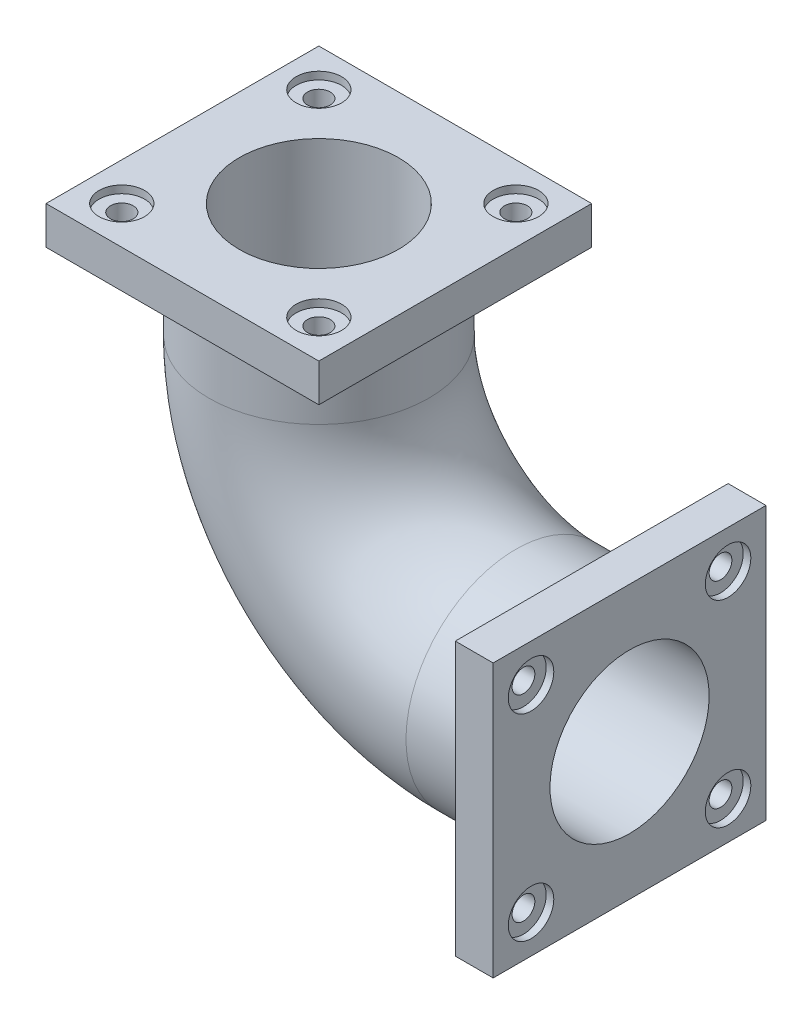
ISO-10303-21;
HEADER;
FILE_DESCRIPTION(('STEP AP214'),'2;1');
FILE_NAME('part.step','',(''),(''),'','','');
FILE_SCHEMA(('AUTOMOTIVE_DESIGN { 1 0 10303 214 1 1 1 1 }'));
ENDSEC;
DATA;
#1=APPLICATION_CONTEXT('core data for automotive mechanical design processes');
#2=APPLICATION_PROTOCOL_DEFINITION('international standard','automotive_design',2000,#1);
#3=PRODUCT_CONTEXT('',#1,'mechanical');
#4=PRODUCT('Part','Part','',(#3));
#5=PRODUCT_RELATED_PRODUCT_CATEGORY('part','',(#4));
#6=PRODUCT_DEFINITION_FORMATION('','',#4);
#7=PRODUCT_DEFINITION_CONTEXT('part definition',#1,'design');
#8=PRODUCT_DEFINITION('design','',#6,#7);
#9=PRODUCT_DEFINITION_SHAPE('','',#8);
#10=(LENGTH_UNIT() NAMED_UNIT(*) SI_UNIT(.MILLI.,.METRE.));
#11=(NAMED_UNIT(*) PLANE_ANGLE_UNIT() SI_UNIT($,.RADIAN.));
#12=(NAMED_UNIT(*) SI_UNIT($,.STERADIAN.) SOLID_ANGLE_UNIT());
#13=UNCERTAINTY_MEASURE_WITH_UNIT(LENGTH_MEASURE(1.E-05),#10,'distance_accuracy_value','');
#14=(GEOMETRIC_REPRESENTATION_CONTEXT(3) GLOBAL_UNCERTAINTY_ASSIGNED_CONTEXT((#13)) GLOBAL_UNIT_ASSIGNED_CONTEXT((#10,
#11,#12)) REPRESENTATION_CONTEXT('',''));
#15=CARTESIAN_POINT('',(0.,0.,0.));
#16=DIRECTION('',(0.,0.,1.));
#17=DIRECTION('',(1.,0.,0.));
#18=AXIS2_PLACEMENT_3D('',#15,#16,#17);
#19=CARTESIAN_POINT('',(-50.,0.,0.));
#20=DIRECTION('',(-1.,0.,0.));
#21=DIRECTION('',(0.,-1.,0.));
#22=AXIS2_PLACEMENT_3D('',#19,#20,#21);
#23=CYLINDRICAL_SURFACE('',#22,105.);
#24=CARTESIAN_POINT('',(-150.,0.,0.));
#25=DIRECTION('',(1.,0.,0.));
#26=DIRECTION('',(0.,0.,-1.));
#27=AXIS2_PLACEMENT_3D('',#24,#25,#26);
#28=CIRCLE('',#27,105.);
#29=CARTESIAN_POINT('',(-150.,-105.,0.));
#30=VERTEX_POINT('',#29);
#31=EDGE_CURVE('E834',#30,#30,#28,.T.);
#32=ORIENTED_EDGE('',*,*,#31,.F.);
#33=EDGE_LOOP('',(#32));
#34=FACE_BOUND('',#33,.T.);
#35=CARTESIAN_POINT('',(0.,0.,0.));
#36=DIRECTION('',(1.,0.,0.));
#37=DIRECTION('',(0.,0.,-1.));
#38=AXIS2_PLACEMENT_3D('',#35,#36,#37);
#39=CIRCLE('',#38,105.);
#40=CARTESIAN_POINT('',(0.,0.,-105.));
#41=VERTEX_POINT('',#40);
#42=EDGE_CURVE('E837',#41,#41,#39,.T.);
#43=ORIENTED_EDGE('',*,*,#42,.T.);
#44=EDGE_LOOP('',(#43));
#45=FACE_BOUND('',#44,.T.);
#46=ADVANCED_FACE('F55',(#34,#45),#23,.F.);
#47=CARTESIAN_POINT('',(-150.,260.,0.));
#48=DIRECTION('',(0.,0.,-1.));
#49=DIRECTION('',(-1.,0.,0.));
#50=AXIS2_PLACEMENT_3D('',#47,#48,#49);
#51=TOROIDAL_SURFACE('',#50,260.,105.);
#52=CARTESIAN_POINT('',(-410.,260.,0.));
#53=DIRECTION('',(0.,-1.,0.));
#54=DIRECTION('',(0.,0.,-1.));
#55=AXIS2_PLACEMENT_3D('',#52,#53,#54);
#56=CIRCLE('',#55,105.);
#57=CARTESIAN_POINT('',(-515.,260.,0.));
#58=VERTEX_POINT('',#57);
#59=EDGE_CURVE('E842',#58,#58,#56,.T.);
#60=CARTESIAN_POINT('',(-150.,260.,0.));
#61=DIRECTION('',(0.,0.,-1.));
#62=DIRECTION('',(-1.,0.,0.));
#63=AXIS2_PLACEMENT_3D('',#60,#61,#62);
#64=CIRCLE('',#63,365.);
#65=EDGE_CURVE('',#30,#58,#64,.T.);
#66=ORIENTED_EDGE('',*,*,#31,.T.);
#67=ORIENTED_EDGE('',*,*,#59,.F.);
#68=ORIENTED_EDGE('',*,*,#65,.T.);
#69=ORIENTED_EDGE('',*,*,#65,.F.);
#70=EDGE_LOOP('',(#66,#68,#67,#69));
#71=FACE_BOUND('',#70,.T.);
#72=ADVANCED_FACE('F362',(#71),#51,.F.);
#73=CARTESIAN_POINT('',(-410.,260.,0.));
#74=DIRECTION('',(0.,1.,0.));
#75=DIRECTION('',(0.,0.,1.));
#76=AXIS2_PLACEMENT_3D('',#73,#74,#75);
#77=CYLINDRICAL_SURFACE('',#76,105.);
#78=ORIENTED_EDGE('',*,*,#59,.T.);
#79=EDGE_LOOP('',(#78));
#80=FACE_BOUND('',#79,.T.);
#81=CARTESIAN_POINT('',(-410.,410.,0.));
#82=DIRECTION('',(0.,1.,0.));
#83=DIRECTION('',(0.,0.,1.));
#84=AXIS2_PLACEMENT_3D('',#81,#82,#83);
#85=CIRCLE('',#84,105.);
#86=CARTESIAN_POINT('',(-410.,410.,105.));
#87=VERTEX_POINT('',#86);
#88=EDGE_CURVE('E501',#87,#87,#85,.T.);
#89=ORIENTED_EDGE('',*,*,#88,.T.);
#90=EDGE_LOOP('',(#89));
#91=FACE_BOUND('',#90,.T.);
#92=ADVANCED_FACE('F359',(#80,#91),#77,.F.);
#93=CARTESIAN_POINT('',(-50.,130.,130.));
#94=DIRECTION('',(1.,0.,0.));
#95=DIRECTION('',(0.,0.,-1.));
#96=AXIS2_PLACEMENT_3D('',#93,#94,#95);
#97=CYLINDRICAL_SURFACE('',#96,15.);
#98=CARTESIAN_POINT('',(-50.,130.,130.));
#99=DIRECTION('',(1.,0.,0.));
#100=DIRECTION('',(0.,0.,-1.));
#101=AXIS2_PLACEMENT_3D('',#98,#99,#100);
#102=CIRCLE('',#101,15.);
#103=CARTESIAN_POINT('',(-50.,130.,115.));
#104=VERTEX_POINT('',#103);
#105=EDGE_CURVE('E285',#104,#104,#102,.T.);
#106=ORIENTED_EDGE('',*,*,#105,.F.);
#107=EDGE_LOOP('',(#106));
#108=FACE_BOUND('',#107,.T.);
#109=CARTESIAN_POINT('',(-10.,130.,130.));
#110=DIRECTION('',(1.,0.,0.));
#111=DIRECTION('',(0.,0.,-1.));
#112=AXIS2_PLACEMENT_3D('',#109,#110,#111);
#113=CIRCLE('',#112,15.);
#114=CARTESIAN_POINT('',(-10.,130.,115.));
#115=VERTEX_POINT('',#114);
#116=EDGE_CURVE('E59',#115,#115,#113,.F.);
#117=ORIENTED_EDGE('',*,*,#116,.F.);
#118=EDGE_LOOP('',(#117));
#119=FACE_BOUND('',#118,.T.);
#120=ADVANCED_FACE('F361',(#108,#119),#97,.F.);
#121=CARTESIAN_POINT('',(-50.,130.,-130.));
#122=DIRECTION('',(1.,0.,0.));
#123=DIRECTION('',(0.,0.,-1.));
#124=AXIS2_PLACEMENT_3D('',#121,#122,#123);
#125=CYLINDRICAL_SURFACE('',#124,15.);
#126=CARTESIAN_POINT('',(-50.,130.,-130.));
#127=DIRECTION('',(1.,0.,0.));
#128=DIRECTION('',(0.,0.,-1.));
#129=AXIS2_PLACEMENT_3D('',#126,#127,#128);
#130=CIRCLE('',#129,15.);
#131=CARTESIAN_POINT('',(-50.,130.,-145.));
#132=VERTEX_POINT('',#131);
#133=EDGE_CURVE('E281',#132,#132,#130,.T.);
#134=ORIENTED_EDGE('',*,*,#133,.F.);
#135=EDGE_LOOP('',(#134));
#136=FACE_BOUND('',#135,.T.);
#137=CARTESIAN_POINT('',(-10.,130.,-130.));
#138=DIRECTION('',(1.,0.,0.));
#139=DIRECTION('',(0.,0.,-1.));
#140=AXIS2_PLACEMENT_3D('',#137,#138,#139);
#141=CIRCLE('',#140,15.);
#142=CARTESIAN_POINT('',(-10.,130.,-145.));
#143=VERTEX_POINT('',#142);
#144=EDGE_CURVE('E263',#143,#143,#141,.F.);
#145=ORIENTED_EDGE('',*,*,#144,.F.);
#146=EDGE_LOOP('',(#145));
#147=FACE_BOUND('',#146,.T.);
#148=ADVANCED_FACE('F369',(#136,#147),#125,.F.);
#149=CARTESIAN_POINT('',(-50.,-130.,-130.));
#150=DIRECTION('',(1.,0.,0.));
#151=DIRECTION('',(0.,0.,-1.));
#152=AXIS2_PLACEMENT_3D('',#149,#150,#151);
#153=CYLINDRICAL_SURFACE('',#152,15.);
#154=CARTESIAN_POINT('',(-50.,-130.,-130.));
#155=DIRECTION('',(1.,0.,0.));
#156=DIRECTION('',(0.,0.,-1.));
#157=AXIS2_PLACEMENT_3D('',#154,#155,#156);
#158=CIRCLE('',#157,15.);
#159=CARTESIAN_POINT('',(-50.,-130.,-145.));
#160=VERTEX_POINT('',#159);
#161=EDGE_CURVE('E275',#160,#160,#158,.T.);
#162=ORIENTED_EDGE('',*,*,#161,.F.);
#163=EDGE_LOOP('',(#162));
#164=FACE_BOUND('',#163,.T.);
#165=CARTESIAN_POINT('',(-10.,-130.,-130.));
#166=DIRECTION('',(1.,0.,0.));
#167=DIRECTION('',(0.,0.,-1.));
#168=AXIS2_PLACEMENT_3D('',#165,#166,#167);
#169=CIRCLE('',#168,15.);
#170=CARTESIAN_POINT('',(-10.,-130.,-145.));
#171=VERTEX_POINT('',#170);
#172=EDGE_CURVE('E259',#171,#171,#169,.F.);
#173=ORIENTED_EDGE('',*,*,#172,.F.);
#174=EDGE_LOOP('',(#173));
#175=FACE_BOUND('',#174,.T.);
#176=ADVANCED_FACE('F413',(#164,#175),#153,.F.);
#177=CARTESIAN_POINT('',(-50.,-130.,130.));
#178=DIRECTION('',(1.,0.,0.));
#179=DIRECTION('',(0.,0.,-1.));
#180=AXIS2_PLACEMENT_3D('',#177,#178,#179);
#181=CYLINDRICAL_SURFACE('',#180,15.);
#182=CARTESIAN_POINT('',(-50.,-130.,130.));
#183=DIRECTION('',(1.,0.,0.));
#184=DIRECTION('',(0.,0.,-1.));
#185=AXIS2_PLACEMENT_3D('',#182,#183,#184);
#186=CIRCLE('',#185,15.);
#187=CARTESIAN_POINT('',(-50.,-130.,115.));
#188=VERTEX_POINT('',#187);
#189=EDGE_CURVE('E270',#188,#188,#186,.T.);
#190=ORIENTED_EDGE('',*,*,#189,.F.);
#191=EDGE_LOOP('',(#190));
#192=FACE_BOUND('',#191,.T.);
#193=CARTESIAN_POINT('',(-10.,-130.,130.));
#194=DIRECTION('',(1.,0.,0.));
#195=DIRECTION('',(0.,0.,-1.));
#196=AXIS2_PLACEMENT_3D('',#193,#194,#195);
#197=CIRCLE('',#196,15.);
#198=CARTESIAN_POINT('',(-10.,-130.,115.));
#199=VERTEX_POINT('',#198);
#200=EDGE_CURVE('E255',#199,#199,#197,.F.);
#201=ORIENTED_EDGE('',*,*,#200,.F.);
#202=EDGE_LOOP('',(#201));
#203=FACE_BOUND('',#202,.T.);
#204=ADVANCED_FACE('F417',(#192,#203),#181,.F.);
#205=CARTESIAN_POINT('',(-540.,360.,-130.));
#206=DIRECTION('',(0.,1.,0.));
#207=DIRECTION('',(0.,0.,1.));
#208=AXIS2_PLACEMENT_3D('',#205,#206,#207);
#209=CYLINDRICAL_SURFACE('',#208,15.);
#210=CARTESIAN_POINT('',(-540.,360.,-130.));
#211=DIRECTION('',(0.,1.,0.));
#212=DIRECTION('',(0.,0.,1.));
#213=AXIS2_PLACEMENT_3D('',#210,#211,#212);
#214=CIRCLE('',#213,15.);
#215=CARTESIAN_POINT('',(-540.,360.,-115.));
#216=VERTEX_POINT('',#215);
#217=EDGE_CURVE('E168',#216,#216,#214,.T.);
#218=ORIENTED_EDGE('',*,*,#217,.F.);
#219=EDGE_LOOP('',(#218));
#220=FACE_BOUND('',#219,.T.);
#221=CARTESIAN_POINT('',(-540.,400.,-130.));
#222=DIRECTION('',(0.,1.,0.));
#223=DIRECTION('',(0.,0.,1.));
#224=AXIS2_PLACEMENT_3D('',#221,#222,#223);
#225=CIRCLE('',#224,15.);
#226=CARTESIAN_POINT('',(-540.,400.,-115.));
#227=VERTEX_POINT('',#226);
#228=EDGE_CURVE('E250',#227,#227,#225,.F.);
#229=ORIENTED_EDGE('',*,*,#228,.F.);
#230=EDGE_LOOP('',(#229));
#231=FACE_BOUND('',#230,.T.);
#232=ADVANCED_FACE('F420',(#220,#231),#209,.F.);
#233=CARTESIAN_POINT('',(-280.,360.,130.));
#234=DIRECTION('',(0.,1.,0.));
#235=DIRECTION('',(0.,0.,1.));
#236=AXIS2_PLACEMENT_3D('',#233,#234,#235);
#237=CYLINDRICAL_SURFACE('',#236,15.);
#238=CARTESIAN_POINT('',(-280.,360.,130.));
#239=DIRECTION('',(0.,1.,0.));
#240=DIRECTION('',(0.,0.,1.));
#241=AXIS2_PLACEMENT_3D('',#238,#239,#240);
#242=CIRCLE('',#241,15.);
#243=CARTESIAN_POINT('',(-280.,360.,145.));
#244=VERTEX_POINT('',#243);
#245=EDGE_CURVE('E254',#244,#244,#242,.T.);
#246=ORIENTED_EDGE('',*,*,#245,.F.);
#247=EDGE_LOOP('',(#246));
#248=FACE_BOUND('',#247,.T.);
#249=CARTESIAN_POINT('',(-280.,400.,130.));
#250=DIRECTION('',(0.,1.,0.));
#251=DIRECTION('',(0.,0.,1.));
#252=AXIS2_PLACEMENT_3D('',#249,#250,#251);
#253=CIRCLE('',#252,15.);
#254=CARTESIAN_POINT('',(-280.,400.,145.));
#255=VERTEX_POINT('',#254);
#256=EDGE_CURVE('E246',#255,#255,#253,.F.);
#257=ORIENTED_EDGE('',*,*,#256,.F.);
#258=EDGE_LOOP('',(#257));
#259=FACE_BOUND('',#258,.T.);
#260=ADVANCED_FACE('F338',(#248,#259),#237,.F.);
#261=CARTESIAN_POINT('',(-540.,360.,130.));
#262=DIRECTION('',(0.,1.,0.));
#263=DIRECTION('',(0.,0.,1.));
#264=AXIS2_PLACEMENT_3D('',#261,#262,#263);
#265=CYLINDRICAL_SURFACE('',#264,15.);
#266=CARTESIAN_POINT('',(-540.,360.,130.));
#267=DIRECTION('',(0.,1.,0.));
#268=DIRECTION('',(0.,0.,1.));
#269=AXIS2_PLACEMENT_3D('',#266,#267,#268);
#270=CIRCLE('',#269,15.);
#271=CARTESIAN_POINT('',(-540.,360.,145.));
#272=VERTEX_POINT('',#271);
#273=EDGE_CURVE('E323',#272,#272,#270,.T.);
#274=ORIENTED_EDGE('',*,*,#273,.F.);
#275=EDGE_LOOP('',(#274));
#276=FACE_BOUND('',#275,.T.);
#277=CARTESIAN_POINT('',(-540.,400.,130.));
#278=DIRECTION('',(0.,1.,0.));
#279=DIRECTION('',(0.,0.,1.));
#280=AXIS2_PLACEMENT_3D('',#277,#278,#279);
#281=CIRCLE('',#280,15.);
#282=CARTESIAN_POINT('',(-540.,400.,145.));
#283=VERTEX_POINT('',#282);
#284=EDGE_CURVE('E241',#283,#283,#281,.F.);
#285=ORIENTED_EDGE('',*,*,#284,.F.);
#286=EDGE_LOOP('',(#285));
#287=FACE_BOUND('',#286,.T.);
#288=ADVANCED_FACE('F334',(#276,#287),#265,.F.);
#289=CARTESIAN_POINT('',(-280.,360.,-130.));
#290=DIRECTION('',(0.,1.,0.));
#291=DIRECTION('',(0.,0.,1.));
#292=AXIS2_PLACEMENT_3D('',#289,#290,#291);
#293=CYLINDRICAL_SURFACE('',#292,15.);
#294=CARTESIAN_POINT('',(-280.,360.,-130.));
#295=DIRECTION('',(0.,1.,0.));
#296=DIRECTION('',(0.,0.,1.));
#297=AXIS2_PLACEMENT_3D('',#294,#295,#296);
#298=CIRCLE('',#297,15.);
#299=CARTESIAN_POINT('',(-280.,360.,-115.));
#300=VERTEX_POINT('',#299);
#301=EDGE_CURVE('E324',#300,#300,#298,.T.);
#302=ORIENTED_EDGE('',*,*,#301,.F.);
#303=EDGE_LOOP('',(#302));
#304=FACE_BOUND('',#303,.T.);
#305=CARTESIAN_POINT('',(-280.,400.,-130.));
#306=DIRECTION('',(0.,1.,0.));
#307=DIRECTION('',(0.,0.,1.));
#308=AXIS2_PLACEMENT_3D('',#305,#306,#307);
#309=CIRCLE('',#308,15.);
#310=CARTESIAN_POINT('',(-280.,400.,-115.));
#311=VERTEX_POINT('',#310);
#312=EDGE_CURVE('E237',#311,#311,#309,.F.);
#313=ORIENTED_EDGE('',*,*,#312,.F.);
#314=EDGE_LOOP('',(#313));
#315=FACE_BOUND('',#314,.T.);
#316=ADVANCED_FACE('F337',(#304,#315),#293,.F.);
#317=CARTESIAN_POINT('',(0.,0.,0.));
#318=DIRECTION('',(-1.,0.,0.));
#319=DIRECTION('',(0.,0.,1.));
#320=AXIS2_PLACEMENT_3D('',#317,#318,#319);
#321=CYLINDRICAL_SURFACE('',#320,145.);
#322=CARTESIAN_POINT('',(-150.,0.,0.));
#323=DIRECTION('',(1.,0.,0.));
#324=DIRECTION('',(0.,0.,-1.));
#325=AXIS2_PLACEMENT_3D('',#322,#323,#324);
#326=CIRCLE('',#325,145.);
#327=CARTESIAN_POINT('',(-150.,-145.,0.));
#328=VERTEX_POINT('',#327);
#329=EDGE_CURVE('E219',#328,#328,#326,.T.);
#330=ORIENTED_EDGE('',*,*,#329,.T.);
#331=EDGE_LOOP('',(#330));
#332=FACE_BOUND('',#331,.T.);
#333=CARTESIAN_POINT('',(-50.,0.,0.));
#334=DIRECTION('',(1.,0.,0.));
#335=DIRECTION('',(0.,0.,-1.));
#336=AXIS2_PLACEMENT_3D('',#333,#334,#335);
#337=CIRCLE('',#336,145.);
#338=CARTESIAN_POINT('',(-50.,0.,-145.));
#339=VERTEX_POINT('',#338);
#340=EDGE_CURVE('E12',#339,#339,#337,.T.);
#341=ORIENTED_EDGE('',*,*,#340,.F.);
#342=EDGE_LOOP('',(#341));
#343=FACE_BOUND('',#342,.T.);
#344=ADVANCED_FACE('F451',(#332,#343),#321,.T.);
#345=CARTESIAN_POINT('',(-410.,260.,0.));
#346=DIRECTION('',(0.,1.,0.));
#347=DIRECTION('',(0.,0.,1.));
#348=AXIS2_PLACEMENT_3D('',#345,#346,#347);
#349=CYLINDRICAL_SURFACE('',#348,145.);
#350=CARTESIAN_POINT('',(-410.,260.,0.));
#351=DIRECTION('',(0.,-1.,0.));
#352=DIRECTION('',(0.,0.,-1.));
#353=AXIS2_PLACEMENT_3D('',#350,#351,#352);
#354=CIRCLE('',#353,145.);
#355=CARTESIAN_POINT('',(-555.,260.,0.));
#356=VERTEX_POINT('',#355);
#357=EDGE_CURVE('E230',#356,#356,#354,.T.);
#358=ORIENTED_EDGE('',*,*,#357,.F.);
#359=EDGE_LOOP('',(#358));
#360=FACE_BOUND('',#359,.T.);
#361=CARTESIAN_POINT('',(-410.,360.,0.));
#362=DIRECTION('',(0.,1.,0.));
#363=DIRECTION('',(0.,0.,1.));
#364=AXIS2_PLACEMENT_3D('',#361,#362,#363);
#365=CIRCLE('',#364,145.);
#366=CARTESIAN_POINT('',(-410.,360.,145.));
#367=VERTEX_POINT('',#366);
#368=EDGE_CURVE('E66',#367,#367,#365,.T.);
#369=ORIENTED_EDGE('',*,*,#368,.F.);
#370=EDGE_LOOP('',(#369));
#371=FACE_BOUND('',#370,.T.);
#372=ADVANCED_FACE('F487',(#360,#371),#349,.T.);
#373=CARTESIAN_POINT('',(-150.,260.,0.));
#374=DIRECTION('',(0.,0.,-1.));
#375=DIRECTION('',(-1.,0.,0.));
#376=AXIS2_PLACEMENT_3D('',#373,#374,#375);
#377=TOROIDAL_SURFACE('',#376,260.,145.);
#378=CARTESIAN_POINT('',(-150.,260.,0.));
#379=DIRECTION('',(0.,0.,-1.));
#380=DIRECTION('',(-1.,0.,0.));
#381=AXIS2_PLACEMENT_3D('',#378,#379,#380);
#382=CIRCLE('',#381,405.);
#383=EDGE_CURVE('',#328,#356,#382,.T.);
#384=ORIENTED_EDGE('',*,*,#329,.F.);
#385=ORIENTED_EDGE('',*,*,#357,.T.);
#386=ORIENTED_EDGE('',*,*,#383,.T.);
#387=ORIENTED_EDGE('',*,*,#383,.F.);
#388=EDGE_LOOP('',(#384,#386,#385,#387));
#389=FACE_BOUND('',#388,.T.);
#390=ADVANCED_FACE('F484',(#389),#377,.T.);
#391=CARTESIAN_POINT('',(-230.,360.,-180.));
#392=DIRECTION('',(1.,0.,0.));
#393=DIRECTION('',(0.,0.,-1.));
#394=AXIS2_PLACEMENT_3D('',#391,#392,#393);
#395=PLANE('',#394);
#396=DIRECTION('',(0.,0.,-1.));
#397=VECTOR('',#396,1.);
#398=CARTESIAN_POINT('',(-230.,410.,-180.));
#399=LINE('',#398,#397);
#400=CARTESIAN_POINT('',(-230.,410.,180.));
#401=VERTEX_POINT('',#400);
#402=CARTESIAN_POINT('',(-230.,410.,-180.));
#403=VERTEX_POINT('',#402);
#404=EDGE_CURVE('E185',#401,#403,#399,.T.);
#405=ORIENTED_EDGE('',*,*,#404,.F.);
#406=DIRECTION('',(0.,1.,0.));
#407=VECTOR('',#406,1.);
#408=CARTESIAN_POINT('',(-230.,360.,180.));
#409=LINE('',#408,#407);
#410=CARTESIAN_POINT('',(-230.,360.,180.));
#411=VERTEX_POINT('',#410);
#412=EDGE_CURVE('E75',#411,#401,#409,.T.);
#413=ORIENTED_EDGE('',*,*,#412,.F.);
#414=DIRECTION('',(0.,0.,-1.));
#415=VECTOR('',#414,1.);
#416=CARTESIAN_POINT('',(-230.,360.,-180.));
#417=LINE('',#416,#415);
#418=CARTESIAN_POINT('',(-230.,360.,-180.));
#419=VERTEX_POINT('',#418);
#420=EDGE_CURVE('E191',#411,#419,#417,.T.);
#421=ORIENTED_EDGE('',*,*,#420,.T.);
#422=DIRECTION('',(0.,1.,0.));
#423=VECTOR('',#422,1.);
#424=CARTESIAN_POINT('',(-230.,360.,-180.));
#425=LINE('',#424,#423);
#426=EDGE_CURVE('E104',#419,#403,#425,.T.);
#427=ORIENTED_EDGE('',*,*,#426,.T.);
#428=EDGE_LOOP('',(#405,#413,#421,#427));
#429=FACE_BOUND('',#428,.T.);
#430=ADVANCED_FACE('F477',(#429),#395,.T.);
#431=CARTESIAN_POINT('',(-590.,360.,180.));
#432=DIRECTION('',(0.,0.,1.));
#433=DIRECTION('',(1.,0.,0.));
#434=AXIS2_PLACEMENT_3D('',#431,#432,#433);
#435=PLANE('',#434);
#436=DIRECTION('',(1.,0.,0.));
#437=VECTOR('',#436,1.);
#438=CARTESIAN_POINT('',(-590.,410.,180.));
#439=LINE('',#438,#437);
#440=CARTESIAN_POINT('',(-590.,410.,180.));
#441=VERTEX_POINT('',#440);
#442=EDGE_CURVE('E195',#441,#401,#439,.T.);
#443=ORIENTED_EDGE('',*,*,#442,.F.);
#444=DIRECTION('',(0.,1.,0.));
#445=VECTOR('',#444,1.);
#446=CARTESIAN_POINT('',(-590.,360.,180.));
#447=LINE('',#446,#445);
#448=CARTESIAN_POINT('',(-590.,360.,180.));
#449=VERTEX_POINT('',#448);
#450=EDGE_CURVE('E93',#449,#441,#447,.T.);
#451=ORIENTED_EDGE('',*,*,#450,.F.);
#452=DIRECTION('',(1.,0.,0.));
#453=VECTOR('',#452,1.);
#454=CARTESIAN_POINT('',(-590.,360.,180.));
#455=LINE('',#454,#453);
#456=EDGE_CURVE('E201',#449,#411,#455,.T.);
#457=ORIENTED_EDGE('',*,*,#456,.T.);
#458=ORIENTED_EDGE('',*,*,#412,.T.);
#459=EDGE_LOOP('',(#443,#451,#457,#458));
#460=FACE_BOUND('',#459,.T.);
#461=ADVANCED_FACE('F473',(#460),#435,.T.);
#462=CARTESIAN_POINT('',(-590.,360.,-180.));
#463=DIRECTION('',(-1.,0.,0.));
#464=DIRECTION('',(0.,0.,1.));
#465=AXIS2_PLACEMENT_3D('',#462,#463,#464);
#466=PLANE('',#465);
#467=DIRECTION('',(0.,0.,1.));
#468=VECTOR('',#467,1.);
#469=CARTESIAN_POINT('',(-590.,410.,-180.));
#470=LINE('',#469,#468);
#471=CARTESIAN_POINT('',(-590.,410.,-180.));
#472=VERTEX_POINT('',#471);
#473=EDGE_CURVE('E211',#472,#441,#470,.T.);
#474=ORIENTED_EDGE('',*,*,#473,.F.);
#475=DIRECTION('',(0.,1.,0.));
#476=VECTOR('',#475,1.);
#477=CARTESIAN_POINT('',(-590.,360.,-180.));
#478=LINE('',#477,#476);
#479=CARTESIAN_POINT('',(-590.,360.,-180.));
#480=VERTEX_POINT('',#479);
#481=EDGE_CURVE('E222',#480,#472,#478,.T.);
#482=ORIENTED_EDGE('',*,*,#481,.F.);
#483=DIRECTION('',(0.,0.,1.));
#484=VECTOR('',#483,1.);
#485=CARTESIAN_POINT('',(-590.,360.,-180.));
#486=LINE('',#485,#484);
#487=EDGE_CURVE('E198',#480,#449,#486,.T.);
#488=ORIENTED_EDGE('',*,*,#487,.T.);
#489=ORIENTED_EDGE('',*,*,#450,.T.);
#490=EDGE_LOOP('',(#474,#482,#488,#489));
#491=FACE_BOUND('',#490,.T.);
#492=ADVANCED_FACE('F476',(#491),#466,.T.);
#493=CARTESIAN_POINT('',(-590.,360.,-180.));
#494=DIRECTION('',(0.,0.,-1.));
#495=DIRECTION('',(-1.,0.,0.));
#496=AXIS2_PLACEMENT_3D('',#493,#494,#495);
#497=PLANE('',#496);
#498=DIRECTION('',(-1.,0.,0.));
#499=VECTOR('',#498,1.);
#500=CARTESIAN_POINT('',(-590.,410.,-180.));
#501=LINE('',#500,#499);
#502=EDGE_CURVE('E207',#403,#472,#501,.T.);
#503=ORIENTED_EDGE('',*,*,#502,.F.);
#504=ORIENTED_EDGE('',*,*,#426,.F.);
#505=DIRECTION('',(-1.,0.,0.));
#506=VECTOR('',#505,1.);
#507=CARTESIAN_POINT('',(-590.,360.,-180.));
#508=LINE('',#507,#506);
#509=EDGE_CURVE('E194',#419,#480,#508,.T.);
#510=ORIENTED_EDGE('',*,*,#509,.T.);
#511=ORIENTED_EDGE('',*,*,#481,.T.);
#512=EDGE_LOOP('',(#503,#504,#510,#511));
#513=FACE_BOUND('',#512,.T.);
#514=ADVANCED_FACE('F471',(#513),#497,.T.);
#515=CARTESIAN_POINT('',(0.,360.,0.));
#516=DIRECTION('',(0.,1.,0.));
#517=DIRECTION('',(0.,0.,1.));
#518=AXIS2_PLACEMENT_3D('',#515,#516,#517);
#519=PLANE('',#518);
#520=ORIENTED_EDGE('',*,*,#301,.T.);
#521=EDGE_LOOP('',(#520));
#522=FACE_BOUND('',#521,.T.);
#523=ORIENTED_EDGE('',*,*,#273,.T.);
#524=EDGE_LOOP('',(#523));
#525=FACE_BOUND('',#524,.T.);
#526=ORIENTED_EDGE('',*,*,#245,.T.);
#527=EDGE_LOOP('',(#526));
#528=FACE_BOUND('',#527,.T.);
#529=ORIENTED_EDGE('',*,*,#217,.T.);
#530=EDGE_LOOP('',(#529));
#531=FACE_BOUND('',#530,.T.);
#532=ORIENTED_EDGE('',*,*,#368,.T.);
#533=EDGE_LOOP('',(#532));
#534=FACE_BOUND('',#533,.T.);
#535=ORIENTED_EDGE('',*,*,#420,.F.);
#536=ORIENTED_EDGE('',*,*,#456,.F.);
#537=ORIENTED_EDGE('',*,*,#487,.F.);
#538=ORIENTED_EDGE('',*,*,#509,.F.);
#539=EDGE_LOOP('',(#535,#536,#537,#538));
#540=FACE_BOUND('',#539,.T.);
#541=ADVANCED_FACE('F331',(#522,#525,#528,#531,#534,#540),#519,.F.);
#542=CARTESIAN_POINT('',(-410.,410.,0.));
#543=DIRECTION('',(0.,-1.,0.));
#544=DIRECTION('',(0.,0.,-1.));
#545=AXIS2_PLACEMENT_3D('',#542,#543,#544);
#546=PLANE('',#545);
#547=ORIENTED_EDGE('',*,*,#88,.F.);
#548=EDGE_LOOP('',(#547));
#549=FACE_BOUND('',#548,.T.);
#550=CARTESIAN_POINT('',(-540.,410.,130.));
#551=DIRECTION('',(0.,1.,0.));
#552=DIRECTION('',(0.,0.,1.));
#553=AXIS2_PLACEMENT_3D('',#550,#551,#552);
#554=CIRCLE('',#553,30.);
#555=CARTESIAN_POINT('',(-540.,410.,160.));
#556=VERTEX_POINT('',#555);
#557=EDGE_CURVE('E307',#556,#556,#554,.T.);
#558=ORIENTED_EDGE('',*,*,#557,.F.);
#559=EDGE_LOOP('',(#558));
#560=FACE_BOUND('',#559,.T.);
#561=CARTESIAN_POINT('',(-280.,410.,130.));
#562=DIRECTION('',(0.,1.,0.));
#563=DIRECTION('',(0.,0.,1.));
#564=AXIS2_PLACEMENT_3D('',#561,#562,#563);
#565=CIRCLE('',#564,30.);
#566=CARTESIAN_POINT('',(-280.,410.,160.));
#567=VERTEX_POINT('',#566);
#568=EDGE_CURVE('E299',#567,#567,#565,.T.);
#569=ORIENTED_EDGE('',*,*,#568,.F.);
#570=EDGE_LOOP('',(#569));
#571=FACE_BOUND('',#570,.T.);
#572=CARTESIAN_POINT('',(-280.,410.,-130.));
#573=DIRECTION('',(0.,1.,0.));
#574=DIRECTION('',(0.,0.,1.));
#575=AXIS2_PLACEMENT_3D('',#572,#573,#574);
#576=CIRCLE('',#575,30.);
#577=CARTESIAN_POINT('',(-280.,410.,-100.));
#578=VERTEX_POINT('',#577);
#579=EDGE_CURVE('E290',#578,#578,#576,.T.);
#580=ORIENTED_EDGE('',*,*,#579,.F.);
#581=EDGE_LOOP('',(#580));
#582=FACE_BOUND('',#581,.T.);
#583=CARTESIAN_POINT('',(-540.,410.,-130.));
#584=DIRECTION('',(0.,1.,0.));
#585=DIRECTION('',(0.,0.,1.));
#586=AXIS2_PLACEMENT_3D('',#583,#584,#585);
#587=CIRCLE('',#586,30.);
#588=CARTESIAN_POINT('',(-540.,410.,-99.9999999999999));
#589=VERTEX_POINT('',#588);
#590=EDGE_CURVE('E294',#589,#589,#587,.T.);
#591=ORIENTED_EDGE('',*,*,#590,.F.);
#592=EDGE_LOOP('',(#591));
#593=FACE_BOUND('',#592,.T.);
#594=ORIENTED_EDGE('',*,*,#404,.T.);
#595=ORIENTED_EDGE('',*,*,#502,.T.);
#596=ORIENTED_EDGE('',*,*,#473,.T.);
#597=ORIENTED_EDGE('',*,*,#442,.T.);
#598=EDGE_LOOP('',(#594,#595,#596,#597));
#599=FACE_BOUND('',#598,.T.);
#600=ADVANCED_FACE('F468',(#549,#560,#571,#582,#593,#599),#546,.F.);
#601=CARTESIAN_POINT('',(-50.,180.,-180.));
#602=DIRECTION('',(0.,0.,-1.));
#603=DIRECTION('',(0.,1.,0.));
#604=AXIS2_PLACEMENT_3D('',#601,#602,#603);
#605=PLANE('',#604);
#606=DIRECTION('',(0.,1.,0.));
#607=VECTOR('',#606,1.);
#608=CARTESIAN_POINT('',(0.,180.,-180.));
#609=LINE('',#608,#607);
#610=CARTESIAN_POINT('',(0.,-180.,-180.));
#611=VERTEX_POINT('',#610);
#612=CARTESIAN_POINT('',(0.,180.,-180.));
#613=VERTEX_POINT('',#612);
#614=EDGE_CURVE('E175',#611,#613,#609,.T.);
#615=ORIENTED_EDGE('',*,*,#614,.F.);
#616=DIRECTION('',(1.,0.,0.));
#617=VECTOR('',#616,1.);
#618=CARTESIAN_POINT('',(-50.,-180.,-180.));
#619=LINE('',#618,#617);
#620=CARTESIAN_POINT('',(-50.,-180.,-180.));
#621=VERTEX_POINT('',#620);
#622=EDGE_CURVE('E159',#621,#611,#619,.T.);
#623=ORIENTED_EDGE('',*,*,#622,.F.);
#624=DIRECTION('',(0.,1.,0.));
#625=VECTOR('',#624,1.);
#626=CARTESIAN_POINT('',(-50.,180.,-180.));
#627=LINE('',#626,#625);
#628=CARTESIAN_POINT('',(-50.,180.,-180.));
#629=VERTEX_POINT('',#628);
#630=EDGE_CURVE('E152',#621,#629,#627,.T.);
#631=ORIENTED_EDGE('',*,*,#630,.T.);
#632=DIRECTION('',(1.,0.,0.));
#633=VECTOR('',#632,1.);
#634=CARTESIAN_POINT('',(-50.,180.,-180.));
#635=LINE('',#634,#633);
#636=EDGE_CURVE('E133',#629,#613,#635,.T.);
#637=ORIENTED_EDGE('',*,*,#636,.T.);
#638=EDGE_LOOP('',(#615,#623,#631,#637));
#639=FACE_BOUND('',#638,.T.);
#640=ADVANCED_FACE('F158',(#639),#605,.T.);
#641=CARTESIAN_POINT('',(-50.,-180.,180.));
#642=DIRECTION('',(0.,-1.,0.));
#643=DIRECTION('',(0.,0.,-1.));
#644=AXIS2_PLACEMENT_3D('',#641,#642,#643);
#645=PLANE('',#644);
#646=DIRECTION('',(0.,0.,-1.));
#647=VECTOR('',#646,1.);
#648=CARTESIAN_POINT('',(0.,-180.,180.));
#649=LINE('',#648,#647);
#650=CARTESIAN_POINT('',(0.,-180.,180.));
#651=VERTEX_POINT('',#650);
#652=EDGE_CURVE('E161',#651,#611,#649,.T.);
#653=ORIENTED_EDGE('',*,*,#652,.F.);
#654=DIRECTION('',(1.,0.,0.));
#655=VECTOR('',#654,1.);
#656=CARTESIAN_POINT('',(-50.,-180.,180.));
#657=LINE('',#656,#655);
#658=CARTESIAN_POINT('',(-50.,-180.,180.));
#659=VERTEX_POINT('',#658);
#660=EDGE_CURVE('E186',#659,#651,#657,.T.);
#661=ORIENTED_EDGE('',*,*,#660,.F.);
#662=DIRECTION('',(0.,0.,-1.));
#663=VECTOR('',#662,1.);
#664=CARTESIAN_POINT('',(-50.,-180.,180.));
#665=LINE('',#664,#663);
#666=EDGE_CURVE('E145',#659,#621,#665,.T.);
#667=ORIENTED_EDGE('',*,*,#666,.T.);
#668=ORIENTED_EDGE('',*,*,#622,.T.);
#669=EDGE_LOOP('',(#653,#661,#667,#668));
#670=FACE_BOUND('',#669,.T.);
#671=ADVANCED_FACE('F456',(#670),#645,.T.);
#672=CARTESIAN_POINT('',(-50.,180.,180.));
#673=DIRECTION('',(0.,0.,1.));
#674=DIRECTION('',(0.,-1.,0.));
#675=AXIS2_PLACEMENT_3D('',#672,#673,#674);
#676=PLANE('',#675);
#677=DIRECTION('',(0.,-1.,0.));
#678=VECTOR('',#677,1.);
#679=CARTESIAN_POINT('',(0.,180.,180.));
#680=LINE('',#679,#678);
#681=CARTESIAN_POINT('',(0.,180.,180.));
#682=VERTEX_POINT('',#681);
#683=EDGE_CURVE('E165',#682,#651,#680,.T.);
#684=ORIENTED_EDGE('',*,*,#683,.F.);
#685=DIRECTION('',(1.,0.,0.));
#686=VECTOR('',#685,1.);
#687=CARTESIAN_POINT('',(-50.,180.,180.));
#688=LINE('',#687,#686);
#689=CARTESIAN_POINT('',(-50.,180.,180.));
#690=VERTEX_POINT('',#689);
#691=EDGE_CURVE('E144',#690,#682,#688,.T.);
#692=ORIENTED_EDGE('',*,*,#691,.F.);
#693=DIRECTION('',(0.,-1.,0.));
#694=VECTOR('',#693,1.);
#695=CARTESIAN_POINT('',(-50.,180.,180.));
#696=LINE('',#695,#694);
#697=EDGE_CURVE('E155',#690,#659,#696,.T.);
#698=ORIENTED_EDGE('',*,*,#697,.T.);
#699=ORIENTED_EDGE('',*,*,#660,.T.);
#700=EDGE_LOOP('',(#684,#692,#698,#699));
#701=FACE_BOUND('',#700,.T.);
#702=ADVANCED_FACE('F459',(#701),#676,.T.);
#703=CARTESIAN_POINT('',(-50.,180.,180.));
#704=DIRECTION('',(0.,1.,0.));
#705=DIRECTION('',(0.,0.,1.));
#706=AXIS2_PLACEMENT_3D('',#703,#704,#705);
#707=PLANE('',#706);
#708=DIRECTION('',(0.,0.,1.));
#709=VECTOR('',#708,1.);
#710=CARTESIAN_POINT('',(0.,180.,180.));
#711=LINE('',#710,#709);
#712=EDGE_CURVE('E138',#613,#682,#711,.T.);
#713=ORIENTED_EDGE('',*,*,#712,.F.);
#714=ORIENTED_EDGE('',*,*,#636,.F.);
#715=DIRECTION('',(0.,0.,1.));
#716=VECTOR('',#715,1.);
#717=CARTESIAN_POINT('',(-50.,180.,180.));
#718=LINE('',#717,#716);
#719=EDGE_CURVE('E136',#629,#690,#718,.T.);
#720=ORIENTED_EDGE('',*,*,#719,.T.);
#721=ORIENTED_EDGE('',*,*,#691,.T.);
#722=EDGE_LOOP('',(#713,#714,#720,#721));
#723=FACE_BOUND('',#722,.T.);
#724=ADVANCED_FACE('F135',(#723),#707,.T.);
#725=CARTESIAN_POINT('',(-50.,0.,0.));
#726=DIRECTION('',(1.,0.,0.));
#727=DIRECTION('',(0.,0.,-1.));
#728=AXIS2_PLACEMENT_3D('',#725,#726,#727);
#729=PLANE('',#728);
#730=ORIENTED_EDGE('',*,*,#189,.T.);
#731=EDGE_LOOP('',(#730));
#732=FACE_BOUND('',#731,.T.);
#733=ORIENTED_EDGE('',*,*,#161,.T.);
#734=EDGE_LOOP('',(#733));
#735=FACE_BOUND('',#734,.T.);
#736=ORIENTED_EDGE('',*,*,#133,.T.);
#737=EDGE_LOOP('',(#736));
#738=FACE_BOUND('',#737,.T.);
#739=ORIENTED_EDGE('',*,*,#105,.T.);
#740=EDGE_LOOP('',(#739));
#741=FACE_BOUND('',#740,.T.);
#742=ORIENTED_EDGE('',*,*,#340,.T.);
#743=EDGE_LOOP('',(#742));
#744=FACE_BOUND('',#743,.T.);
#745=ORIENTED_EDGE('',*,*,#630,.F.);
#746=ORIENTED_EDGE('',*,*,#666,.F.);
#747=ORIENTED_EDGE('',*,*,#697,.F.);
#748=ORIENTED_EDGE('',*,*,#719,.F.);
#749=EDGE_LOOP('',(#745,#746,#747,#748));
#750=FACE_BOUND('',#749,.T.);
#751=ADVANCED_FACE('F150',(#732,#735,#738,#741,#744,#750),#729,.F.);
#752=CARTESIAN_POINT('',(0.,0.,0.));
#753=DIRECTION('',(1.,0.,0.));
#754=DIRECTION('',(0.,0.,-1.));
#755=AXIS2_PLACEMENT_3D('',#752,#753,#754);
#756=PLANE('',#755);
#757=ORIENTED_EDGE('',*,*,#42,.F.);
#758=EDGE_LOOP('',(#757));
#759=FACE_BOUND('',#758,.T.);
#760=CARTESIAN_POINT('',(0.,-130.,130.));
#761=DIRECTION('',(1.,0.,0.));
#762=DIRECTION('',(0.,0.,-1.));
#763=AXIS2_PLACEMENT_3D('',#760,#761,#762);
#764=CIRCLE('',#763,30.);
#765=CARTESIAN_POINT('',(0.,-130.,100.));
#766=VERTEX_POINT('',#765);
#767=EDGE_CURVE('E866',#766,#766,#764,.T.);
#768=ORIENTED_EDGE('',*,*,#767,.F.);
#769=EDGE_LOOP('',(#768));
#770=FACE_BOUND('',#769,.T.);
#771=CARTESIAN_POINT('',(0.,-130.,-130.));
#772=DIRECTION('',(1.,0.,0.));
#773=DIRECTION('',(0.,0.,-1.));
#774=AXIS2_PLACEMENT_3D('',#771,#772,#773);
#775=CIRCLE('',#774,30.);
#776=CARTESIAN_POINT('',(0.,-130.,-160.));
#777=VERTEX_POINT('',#776);
#778=EDGE_CURVE('E858',#777,#777,#775,.T.);
#779=ORIENTED_EDGE('',*,*,#778,.F.);
#780=EDGE_LOOP('',(#779));
#781=FACE_BOUND('',#780,.T.);
#782=CARTESIAN_POINT('',(0.,130.,-130.));
#783=DIRECTION('',(1.,0.,0.));
#784=DIRECTION('',(0.,0.,-1.));
#785=AXIS2_PLACEMENT_3D('',#782,#783,#784);
#786=CIRCLE('',#785,30.);
#787=CARTESIAN_POINT('',(0.,130.,-160.));
#788=VERTEX_POINT('',#787);
#789=EDGE_CURVE('E849',#788,#788,#786,.T.);
#790=ORIENTED_EDGE('',*,*,#789,.F.);
#791=EDGE_LOOP('',(#790));
#792=FACE_BOUND('',#791,.T.);
#793=CARTESIAN_POINT('',(0.,130.,130.));
#794=DIRECTION('',(1.,0.,0.));
#795=DIRECTION('',(0.,0.,-1.));
#796=AXIS2_PLACEMENT_3D('',#793,#794,#795);
#797=CIRCLE('',#796,30.);
#798=CARTESIAN_POINT('',(0.,130.,100.));
#799=VERTEX_POINT('',#798);
#800=EDGE_CURVE('E853',#799,#799,#797,.T.);
#801=ORIENTED_EDGE('',*,*,#800,.F.);
#802=EDGE_LOOP('',(#801));
#803=FACE_BOUND('',#802,.T.);
#804=ORIENTED_EDGE('',*,*,#614,.T.);
#805=ORIENTED_EDGE('',*,*,#712,.T.);
#806=ORIENTED_EDGE('',*,*,#683,.T.);
#807=ORIENTED_EDGE('',*,*,#652,.T.);
#808=EDGE_LOOP('',(#804,#805,#806,#807));
#809=FACE_BOUND('',#808,.T.);
#810=ADVANCED_FACE('F57',(#759,#770,#781,#792,#803,#809),#756,.T.);
#811=CARTESIAN_POINT('',(-280.,400.,-130.));
#812=DIRECTION('',(0.,1.,0.));
#813=DIRECTION('',(0.,0.,1.));
#814=AXIS2_PLACEMENT_3D('',#811,#812,#813);
#815=PLANE('',#814);
#816=CARTESIAN_POINT('',(-280.,400.,-130.));
#817=DIRECTION('',(0.,1.,0.));
#818=DIRECTION('',(0.,0.,1.));
#819=AXIS2_PLACEMENT_3D('',#816,#817,#818);
#820=CIRCLE('',#819,30.);
#821=CARTESIAN_POINT('',(-280.,400.,-100.));
#822=VERTEX_POINT('',#821);
#823=EDGE_CURVE('E295',#822,#822,#820,.T.);
#824=ORIENTED_EDGE('',*,*,#823,.T.);
#825=EDGE_LOOP('',(#824));
#826=FACE_BOUND('',#825,.T.);
#827=ORIENTED_EDGE('',*,*,#312,.T.);
#828=EDGE_LOOP('',(#827));
#829=FACE_BOUND('',#828,.T.);
#830=ADVANCED_FACE('F355',(#826,#829),#815,.T.);
#831=CARTESIAN_POINT('',(-280.,400.,-130.));
#832=DIRECTION('',(0.,1.,0.));
#833=DIRECTION('',(0.,0.,1.));
#834=AXIS2_PLACEMENT_3D('',#831,#832,#833);
#835=CYLINDRICAL_SURFACE('',#834,30.);
#836=ORIENTED_EDGE('',*,*,#823,.F.);
#837=EDGE_LOOP('',(#836));
#838=FACE_BOUND('',#837,.T.);
#839=ORIENTED_EDGE('',*,*,#579,.T.);
#840=EDGE_LOOP('',(#839));
#841=FACE_BOUND('',#840,.T.);
#842=ADVANCED_FACE('F345',(#838,#841),#835,.F.);
#843=CARTESIAN_POINT('',(-540.,400.,130.));
#844=DIRECTION('',(0.,1.,0.));
#845=DIRECTION('',(0.,0.,1.));
#846=AXIS2_PLACEMENT_3D('',#843,#844,#845);
#847=PLANE('',#846);
#848=CARTESIAN_POINT('',(-540.,400.,130.));
#849=DIRECTION('',(0.,1.,0.));
#850=DIRECTION('',(0.,0.,1.));
#851=AXIS2_PLACEMENT_3D('',#848,#849,#850);
#852=CIRCLE('',#851,30.);
#853=CARTESIAN_POINT('',(-540.,400.,160.));
#854=VERTEX_POINT('',#853);
#855=EDGE_CURVE('E289',#854,#854,#852,.T.);
#856=ORIENTED_EDGE('',*,*,#855,.T.);
#857=EDGE_LOOP('',(#856));
#858=FACE_BOUND('',#857,.T.);
#859=ORIENTED_EDGE('',*,*,#284,.T.);
#860=EDGE_LOOP('',(#859));
#861=FACE_BOUND('',#860,.T.);
#862=ADVANCED_FACE('F342',(#858,#861),#847,.T.);
#863=CARTESIAN_POINT('',(-540.,400.,130.));
#864=DIRECTION('',(0.,1.,0.));
#865=DIRECTION('',(0.,0.,1.));
#866=AXIS2_PLACEMENT_3D('',#863,#864,#865);
#867=CYLINDRICAL_SURFACE('',#866,30.);
#868=ORIENTED_EDGE('',*,*,#855,.F.);
#869=EDGE_LOOP('',(#868));
#870=FACE_BOUND('',#869,.T.);
#871=ORIENTED_EDGE('',*,*,#557,.T.);
#872=EDGE_LOOP('',(#871));
#873=FACE_BOUND('',#872,.T.);
#874=ADVANCED_FACE('F344',(#870,#873),#867,.F.);
#875=CARTESIAN_POINT('',(-280.,400.,130.));
#876=DIRECTION('',(0.,1.,0.));
#877=DIRECTION('',(0.,0.,1.));
#878=AXIS2_PLACEMENT_3D('',#875,#876,#877);
#879=PLANE('',#878);
#880=CARTESIAN_POINT('',(-280.,400.,130.));
#881=DIRECTION('',(0.,1.,0.));
#882=DIRECTION('',(0.,0.,1.));
#883=AXIS2_PLACEMENT_3D('',#880,#881,#882);
#884=CIRCLE('',#883,30.);
#885=CARTESIAN_POINT('',(-280.,400.,160.));
#886=VERTEX_POINT('',#885);
#887=EDGE_CURVE('E303',#886,#886,#884,.T.);
#888=ORIENTED_EDGE('',*,*,#887,.T.);
#889=EDGE_LOOP('',(#888));
#890=FACE_BOUND('',#889,.T.);
#891=ORIENTED_EDGE('',*,*,#256,.T.);
#892=EDGE_LOOP('',(#891));
#893=FACE_BOUND('',#892,.T.);
#894=ADVANCED_FACE('F352',(#890,#893),#879,.T.);
#895=CARTESIAN_POINT('',(-280.,400.,130.));
#896=DIRECTION('',(0.,1.,0.));
#897=DIRECTION('',(0.,0.,1.));
#898=AXIS2_PLACEMENT_3D('',#895,#896,#897);
#899=CYLINDRICAL_SURFACE('',#898,30.);
#900=ORIENTED_EDGE('',*,*,#887,.F.);
#901=EDGE_LOOP('',(#900));
#902=FACE_BOUND('',#901,.T.);
#903=ORIENTED_EDGE('',*,*,#568,.T.);
#904=EDGE_LOOP('',(#903));
#905=FACE_BOUND('',#904,.T.);
#906=ADVANCED_FACE('F426',(#902,#905),#899,.F.);
#907=CARTESIAN_POINT('',(-540.,400.,-130.));
#908=DIRECTION('',(0.,1.,0.));
#909=DIRECTION('',(0.,0.,1.));
#910=AXIS2_PLACEMENT_3D('',#907,#908,#909);
#911=PLANE('',#910);
#912=CARTESIAN_POINT('',(-540.,400.,-130.));
#913=DIRECTION('',(0.,1.,0.));
#914=DIRECTION('',(0.,0.,1.));
#915=AXIS2_PLACEMENT_3D('',#912,#913,#914);
#916=CIRCLE('',#915,30.);
#917=CARTESIAN_POINT('',(-540.,400.,-99.9999999999999));
#918=VERTEX_POINT('',#917);
#919=EDGE_CURVE('E242',#918,#918,#916,.T.);
#920=ORIENTED_EDGE('',*,*,#919,.T.);
#921=EDGE_LOOP('',(#920));
#922=FACE_BOUND('',#921,.T.);
#923=ORIENTED_EDGE('',*,*,#228,.T.);
#924=EDGE_LOOP('',(#923));
#925=FACE_BOUND('',#924,.T.);
#926=ADVANCED_FACE('F429',(#922,#925),#911,.T.);
#927=CARTESIAN_POINT('',(-540.,400.,-130.));
#928=DIRECTION('',(0.,1.,0.));
#929=DIRECTION('',(0.,0.,1.));
#930=AXIS2_PLACEMENT_3D('',#927,#928,#929);
#931=CYLINDRICAL_SURFACE('',#930,30.);
#932=ORIENTED_EDGE('',*,*,#919,.F.);
#933=EDGE_LOOP('',(#932));
#934=FACE_BOUND('',#933,.T.);
#935=ORIENTED_EDGE('',*,*,#590,.T.);
#936=EDGE_LOOP('',(#935));
#937=FACE_BOUND('',#936,.T.);
#938=ADVANCED_FACE('F402',(#934,#937),#931,.F.);
#939=CARTESIAN_POINT('',(-10.,-130.,130.));
#940=DIRECTION('',(1.,0.,0.));
#941=DIRECTION('',(0.,0.,-1.));
#942=AXIS2_PLACEMENT_3D('',#939,#940,#941);
#943=PLANE('',#942);
#944=CARTESIAN_POINT('',(-10.,-130.,130.));
#945=DIRECTION('',(1.,0.,0.));
#946=DIRECTION('',(0.,0.,-1.));
#947=AXIS2_PLACEMENT_3D('',#944,#945,#946);
#948=CIRCLE('',#947,30.);
#949=CARTESIAN_POINT('',(-10.,-130.,100.));
#950=VERTEX_POINT('',#949);
#951=EDGE_CURVE('E848',#950,#950,#948,.T.);
#952=ORIENTED_EDGE('',*,*,#951,.T.);
#953=EDGE_LOOP('',(#952));
#954=FACE_BOUND('',#953,.T.);
#955=ORIENTED_EDGE('',*,*,#200,.T.);
#956=EDGE_LOOP('',(#955));
#957=FACE_BOUND('',#956,.T.);
#958=ADVANCED_FACE('F398',(#954,#957),#943,.T.);
#959=CARTESIAN_POINT('',(-10.,-130.,130.));
#960=DIRECTION('',(1.,0.,0.));
#961=DIRECTION('',(0.,0.,-1.));
#962=AXIS2_PLACEMENT_3D('',#959,#960,#961);
#963=CYLINDRICAL_SURFACE('',#962,30.);
#964=ORIENTED_EDGE('',*,*,#951,.F.);
#965=EDGE_LOOP('',(#964));
#966=FACE_BOUND('',#965,.T.);
#967=ORIENTED_EDGE('',*,*,#767,.T.);
#968=EDGE_LOOP('',(#967));
#969=FACE_BOUND('',#968,.T.);
#970=ADVANCED_FACE('F394',(#966,#969),#963,.F.);
#971=CARTESIAN_POINT('',(-10.,-130.,-130.));
#972=DIRECTION('',(1.,0.,0.));
#973=DIRECTION('',(0.,0.,-1.));
#974=AXIS2_PLACEMENT_3D('',#971,#972,#973);
#975=PLANE('',#974);
#976=CARTESIAN_POINT('',(-10.,-130.,-130.));
#977=DIRECTION('',(1.,0.,0.));
#978=DIRECTION('',(0.,0.,-1.));
#979=AXIS2_PLACEMENT_3D('',#976,#977,#978);
#980=CIRCLE('',#979,30.);
#981=CARTESIAN_POINT('',(-10.,-130.,-160.));
#982=VERTEX_POINT('',#981);
#983=EDGE_CURVE('E862',#982,#982,#980,.T.);
#984=ORIENTED_EDGE('',*,*,#983,.T.);
#985=EDGE_LOOP('',(#984));
#986=FACE_BOUND('',#985,.T.);
#987=ORIENTED_EDGE('',*,*,#172,.T.);
#988=EDGE_LOOP('',(#987));
#989=FACE_BOUND('',#988,.T.);
#990=ADVANCED_FACE('F390',(#986,#989),#975,.T.);
#991=CARTESIAN_POINT('',(-10.,-130.,-130.));
#992=DIRECTION('',(1.,0.,0.));
#993=DIRECTION('',(0.,0.,-1.));
#994=AXIS2_PLACEMENT_3D('',#991,#992,#993);
#995=CYLINDRICAL_SURFACE('',#994,30.);
#996=ORIENTED_EDGE('',*,*,#983,.F.);
#997=EDGE_LOOP('',(#996));
#998=FACE_BOUND('',#997,.T.);
#999=ORIENTED_EDGE('',*,*,#778,.T.);
#1000=EDGE_LOOP('',(#999));
#1001=FACE_BOUND('',#1000,.T.);
#1002=ADVANCED_FACE('F386',(#998,#1001),#995,.F.);
#1003=CARTESIAN_POINT('',(-10.,130.,-130.));
#1004=DIRECTION('',(1.,0.,0.));
#1005=DIRECTION('',(0.,0.,-1.));
#1006=AXIS2_PLACEMENT_3D('',#1003,#1004,#1005);
#1007=PLANE('',#1006);
#1008=CARTESIAN_POINT('',(-10.,130.,-130.));
#1009=DIRECTION('',(1.,0.,0.));
#1010=DIRECTION('',(0.,0.,-1.));
#1011=AXIS2_PLACEMENT_3D('',#1008,#1009,#1010);
#1012=CIRCLE('',#1011,30.);
#1013=CARTESIAN_POINT('',(-10.,130.,-160.));
#1014=VERTEX_POINT('',#1013);
#1015=EDGE_CURVE('E854',#1014,#1014,#1012,.T.);
#1016=ORIENTED_EDGE('',*,*,#1015,.T.);
#1017=EDGE_LOOP('',(#1016));
#1018=FACE_BOUND('',#1017,.T.);
#1019=ORIENTED_EDGE('',*,*,#144,.T.);
#1020=EDGE_LOOP('',(#1019));
#1021=FACE_BOUND('',#1020,.T.);
#1022=ADVANCED_FACE('F382',(#1018,#1021),#1007,.T.);
#1023=CARTESIAN_POINT('',(-10.,130.,-130.));
#1024=DIRECTION('',(1.,0.,0.));
#1025=DIRECTION('',(0.,0.,-1.));
#1026=AXIS2_PLACEMENT_3D('',#1023,#1024,#1025);
#1027=CYLINDRICAL_SURFACE('',#1026,30.);
#1028=ORIENTED_EDGE('',*,*,#1015,.F.);
#1029=EDGE_LOOP('',(#1028));
#1030=FACE_BOUND('',#1029,.T.);
#1031=ORIENTED_EDGE('',*,*,#789,.T.);
#1032=EDGE_LOOP('',(#1031));
#1033=FACE_BOUND('',#1032,.T.);
#1034=ADVANCED_FACE('F378',(#1030,#1033),#1027,.F.);
#1035=CARTESIAN_POINT('',(-10.,130.,130.));
#1036=DIRECTION('',(1.,0.,0.));
#1037=DIRECTION('',(0.,0.,-1.));
#1038=AXIS2_PLACEMENT_3D('',#1035,#1036,#1037);
#1039=PLANE('',#1038);
#1040=CARTESIAN_POINT('',(-10.,130.,130.));
#1041=DIRECTION('',(1.,0.,0.));
#1042=DIRECTION('',(0.,0.,-1.));
#1043=AXIS2_PLACEMENT_3D('',#1040,#1041,#1042);
#1044=CIRCLE('',#1043,30.);
#1045=CARTESIAN_POINT('',(-10.,130.,100.));
#1046=VERTEX_POINT('',#1045);
#1047=EDGE_CURVE('E260',#1046,#1046,#1044,.T.);
#1048=ORIENTED_EDGE('',*,*,#1047,.T.);
#1049=EDGE_LOOP('',(#1048));
#1050=FACE_BOUND('',#1049,.T.);
#1051=ORIENTED_EDGE('',*,*,#116,.T.);
#1052=EDGE_LOOP('',(#1051));
#1053=FACE_BOUND('',#1052,.T.);
#1054=ADVANCED_FACE('F381',(#1050,#1053),#1039,.T.);
#1055=CARTESIAN_POINT('',(-10.,130.,130.));
#1056=DIRECTION('',(1.,0.,0.));
#1057=DIRECTION('',(0.,0.,-1.));
#1058=AXIS2_PLACEMENT_3D('',#1055,#1056,#1057);
#1059=CYLINDRICAL_SURFACE('',#1058,30.);
#1060=ORIENTED_EDGE('',*,*,#1047,.F.);
#1061=EDGE_LOOP('',(#1060));
#1062=FACE_BOUND('',#1061,.T.);
#1063=ORIENTED_EDGE('',*,*,#800,.T.);
#1064=EDGE_LOOP('',(#1063));
#1065=FACE_BOUND('',#1064,.T.);
#1066=ADVANCED_FACE('F406',(#1062,#1065),#1059,.F.);
#1067=CLOSED_SHELL('',(#46,#72,#92,#120,#148,#176,#204,#232,#260,#288,#316,#344,#372,#390,#430,
#461,#492,#514,#541,#600,#640,#671,#702,#724,#751,#810,#830,#842,#862,#874,#894,#906,#926,#938,
#958,#970,#990,#1002,#1022,#1034,#1054,#1066));
#1068=MANIFOLD_SOLID_BREP('B2',#1067);
#1069=ADVANCED_BREP_SHAPE_REPRESENTATION('',(#18,#1068),#14);
#1070=SHAPE_DEFINITION_REPRESENTATION(#9,#1069);
ENDSEC;
END-ISO-10303-21;
